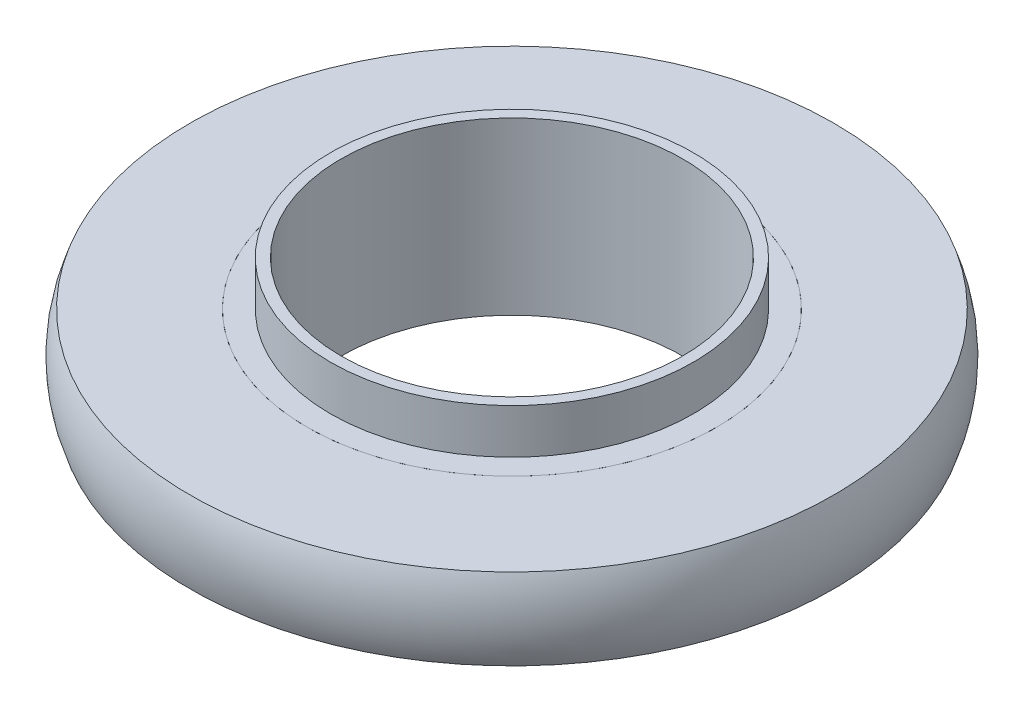
ISO-10303-21;
HEADER;
FILE_DESCRIPTION(('STEP AP214'),'2;1');
FILE_NAME('part.step','',(''),(''),'','','');
FILE_SCHEMA(('AUTOMOTIVE_DESIGN { 1 0 10303 214 1 1 1 1 }'));
ENDSEC;
DATA;
#1=APPLICATION_CONTEXT('core data for automotive mechanical design processes');
#2=APPLICATION_PROTOCOL_DEFINITION('international standard','automotive_design',2000,#1);
#3=PRODUCT_CONTEXT('',#1,'mechanical');
#4=PRODUCT('Part','Part','',(#3));
#5=PRODUCT_RELATED_PRODUCT_CATEGORY('part','',(#4));
#6=PRODUCT_DEFINITION_FORMATION('','',#4);
#7=PRODUCT_DEFINITION_CONTEXT('part definition',#1,'design');
#8=PRODUCT_DEFINITION('design','',#6,#7);
#9=PRODUCT_DEFINITION_SHAPE('','',#8);
#10=(LENGTH_UNIT() NAMED_UNIT(*) SI_UNIT(.MILLI.,.METRE.));
#11=(NAMED_UNIT(*) PLANE_ANGLE_UNIT() SI_UNIT($,.RADIAN.));
#12=(NAMED_UNIT(*) SI_UNIT($,.STERADIAN.) SOLID_ANGLE_UNIT());
#13=UNCERTAINTY_MEASURE_WITH_UNIT(LENGTH_MEASURE(1.E-05),#10,'distance_accuracy_value','');
#14=(GEOMETRIC_REPRESENTATION_CONTEXT(3) GLOBAL_UNCERTAINTY_ASSIGNED_CONTEXT((#13)) GLOBAL_UNIT_ASSIGNED_CONTEXT((#10,
#11,#12)) REPRESENTATION_CONTEXT('',''));
#15=CARTESIAN_POINT('',(0.,0.,0.));
#16=DIRECTION('',(0.,0.,1.));
#17=DIRECTION('',(1.,0.,0.));
#18=AXIS2_PLACEMENT_3D('',#15,#16,#17);
#19=CARTESIAN_POINT('',(0.,0.,0.));
#20=DIRECTION('',(0.,-1.,0.));
#21=DIRECTION('',(0.,0.,-1.));
#22=AXIS2_PLACEMENT_3D('',#19,#20,#21);
#23=TOROIDAL_SURFACE('',#22,14.535,5.3);
#24=CARTESIAN_POINT('',(0.,-1.905,0.));
#25=DIRECTION('',(0.,-1.,0.));
#26=DIRECTION('',(0.,0.,-1.));
#27=AXIS2_PLACEMENT_3D('',#24,#25,#26);
#28=CIRCLE('',#27,9.58919622305939);
#29=CARTESIAN_POINT('',(0.,-1.905,-9.58919622305939));
#30=VERTEX_POINT('',#29);
#31=EDGE_CURVE('E11',#30,#30,#28,.T.);
#32=ORIENTED_EDGE('',*,*,#31,.T.);
#33=EDGE_LOOP('',(#32));
#34=FACE_BOUND('',#33,.T.);
#35=CARTESIAN_POINT('',(0.,1.905,0.));
#36=DIRECTION('',(0.,-1.,0.));
#37=DIRECTION('',(0.,0.,-1.));
#38=AXIS2_PLACEMENT_3D('',#35,#36,#37);
#39=CIRCLE('',#38,9.58919622305939);
#40=CARTESIAN_POINT('',(0.,1.905,-9.58919622305939));
#41=VERTEX_POINT('',#40);
#42=EDGE_CURVE('E56',#41,#41,#39,.T.);
#43=ORIENTED_EDGE('',*,*,#42,.F.);
#44=EDGE_LOOP('',(#43));
#45=FACE_BOUND('',#44,.T.);
#46=ADVANCED_FACE('F42',(#34,#45),#23,.T.);
#47=CARTESIAN_POINT('',(9.58919622305939,-1.905,0.));
#48=DIRECTION('',(0.,-1.,0.));
#49=DIRECTION('',(0.,0.,-1.));
#50=AXIS2_PLACEMENT_3D('',#47,#48,#49);
#51=PLANE('',#50);
#52=CARTESIAN_POINT('',(0.,-1.905,0.));
#53=DIRECTION('',(0.,-1.,0.));
#54=DIRECTION('',(0.,0.,-1.));
#55=AXIS2_PLACEMENT_3D('',#52,#53,#54);
#56=CIRCLE('',#55,15.0808037769406);
#57=CARTESIAN_POINT('',(0.,-1.905,-15.0808037769406));
#58=VERTEX_POINT('',#57);
#59=EDGE_CURVE('E48',#58,#58,#56,.T.);
#60=ORIENTED_EDGE('',*,*,#59,.T.);
#61=EDGE_LOOP('',(#60));
#62=FACE_BOUND('',#61,.T.);
#63=ORIENTED_EDGE('',*,*,#31,.F.);
#64=EDGE_LOOP('',(#63));
#65=FACE_BOUND('',#64,.T.);
#66=ADVANCED_FACE('F66',(#62,#65),#51,.T.);
#67=CARTESIAN_POINT('',(0.,0.,0.));
#68=DIRECTION('',(0.,-1.,0.));
#69=DIRECTION('',(0.,0.,-1.));
#70=AXIS2_PLACEMENT_3D('',#67,#68,#69);
#71=TOROIDAL_SURFACE('',#70,10.135,5.3);
#72=CARTESIAN_POINT('',(0.,1.905,0.));
#73=DIRECTION('',(0.,-1.,0.));
#74=DIRECTION('',(0.,0.,-1.));
#75=AXIS2_PLACEMENT_3D('',#72,#73,#74);
#76=CIRCLE('',#75,15.0808037769406);
#77=CARTESIAN_POINT('',(0.,1.905,-15.0808037769406));
#78=VERTEX_POINT('',#77);
#79=EDGE_CURVE('E52',#78,#78,#76,.T.);
#80=ORIENTED_EDGE('',*,*,#79,.T.);
#81=EDGE_LOOP('',(#80));
#82=FACE_BOUND('',#81,.T.);
#83=ORIENTED_EDGE('',*,*,#59,.F.);
#84=EDGE_LOOP('',(#83));
#85=FACE_BOUND('',#84,.T.);
#86=ADVANCED_FACE('F70',(#82,#85),#71,.T.);
#87=CARTESIAN_POINT('',(9.58919622305939,1.905,0.));
#88=DIRECTION('',(0.,1.,0.));
#89=DIRECTION('',(0.,0.,1.));
#90=AXIS2_PLACEMENT_3D('',#87,#88,#89);
#91=PLANE('',#90);
#92=ORIENTED_EDGE('',*,*,#42,.T.);
#93=EDGE_LOOP('',(#92));
#94=FACE_BOUND('',#93,.T.);
#95=ORIENTED_EDGE('',*,*,#79,.F.);
#96=EDGE_LOOP('',(#95));
#97=FACE_BOUND('',#96,.T.);
#98=ADVANCED_FACE('F62',(#94,#97),#91,.T.);
#99=CLOSED_SHELL('',(#46,#66,#86,#98));
#100=MANIFOLD_SOLID_BREP('B2',#99);
#101=CARTESIAN_POINT('',(8.,4.,0.));
#102=DIRECTION('',(0.,-1.,0.));
#103=DIRECTION('',(0.,0.,-1.));
#104=AXIS2_PLACEMENT_3D('',#101,#102,#103);
#105=PLANE('',#104);
#106=CARTESIAN_POINT('',(0.,4.,0.));
#107=DIRECTION('',(0.,1.,0.));
#108=DIRECTION('',(0.,0.,1.));
#109=AXIS2_PLACEMENT_3D('',#106,#107,#108);
#110=CIRCLE('',#109,8.);
#111=CARTESIAN_POINT('',(0.,4.,8.));
#112=VERTEX_POINT('',#111);
#113=EDGE_CURVE('E41',#112,#112,#110,.T.);
#114=ORIENTED_EDGE('',*,*,#113,.F.);
#115=EDGE_LOOP('',(#114));
#116=FACE_BOUND('',#115,.T.);
#117=CARTESIAN_POINT('',(0.,4.,0.));
#118=DIRECTION('',(0.,1.,0.));
#119=DIRECTION('',(0.,0.,1.));
#120=AXIS2_PLACEMENT_3D('',#117,#118,#119);
#121=CIRCLE('',#120,8.5);
#122=CARTESIAN_POINT('',(0.,4.,8.5));
#123=VERTEX_POINT('',#122);
#124=EDGE_CURVE('E131',#123,#123,#121,.T.);
#125=ORIENTED_EDGE('',*,*,#124,.T.);
#126=EDGE_LOOP('',(#125));
#127=FACE_BOUND('',#126,.T.);
#128=ADVANCED_FACE('F103',(#116,#127),#105,.F.);
#129=CARTESIAN_POINT('',(0.,4.,0.));
#130=DIRECTION('',(0.,1.,0.));
#131=DIRECTION('',(0.,0.,1.));
#132=AXIS2_PLACEMENT_3D('',#129,#130,#131);
#133=CYLINDRICAL_SURFACE('',#132,8.);
#134=CARTESIAN_POINT('',(0.,-4.,0.));
#135=DIRECTION('',(0.,1.,0.));
#136=DIRECTION('',(0.,0.,1.));
#137=AXIS2_PLACEMENT_3D('',#134,#135,#136);
#138=CIRCLE('',#137,8.);
#139=CARTESIAN_POINT('',(0.,-4.,8.));
#140=VERTEX_POINT('',#139);
#141=EDGE_CURVE('E109',#140,#140,#138,.T.);
#142=ORIENTED_EDGE('',*,*,#141,.F.);
#143=EDGE_LOOP('',(#142));
#144=FACE_BOUND('',#143,.T.);
#145=ORIENTED_EDGE('',*,*,#113,.T.);
#146=EDGE_LOOP('',(#145));
#147=FACE_BOUND('',#146,.T.);
#148=ADVANCED_FACE('F168',(#144,#147),#133,.F.);
#149=CARTESIAN_POINT('',(8.,-4.,0.));
#150=DIRECTION('',(0.,1.,0.));
#151=DIRECTION('',(0.,0.,1.));
#152=AXIS2_PLACEMENT_3D('',#149,#150,#151);
#153=PLANE('',#152);
#154=CARTESIAN_POINT('',(0.,-4.,0.));
#155=DIRECTION('',(0.,1.,0.));
#156=DIRECTION('',(0.,0.,1.));
#157=AXIS2_PLACEMENT_3D('',#154,#155,#156);
#158=CIRCLE('',#157,8.5);
#159=CARTESIAN_POINT('',(0.,-4.,8.5));
#160=VERTEX_POINT('',#159);
#161=EDGE_CURVE('E113',#160,#160,#158,.T.);
#162=ORIENTED_EDGE('',*,*,#161,.F.);
#163=EDGE_LOOP('',(#162));
#164=FACE_BOUND('',#163,.T.);
#165=ORIENTED_EDGE('',*,*,#141,.T.);
#166=EDGE_LOOP('',(#165));
#167=FACE_BOUND('',#166,.T.);
#168=ADVANCED_FACE('F163',(#164,#167),#153,.F.);
#169=CARTESIAN_POINT('',(0.,4.,0.));
#170=DIRECTION('',(0.,1.,0.));
#171=DIRECTION('',(0.,0.,1.));
#172=AXIS2_PLACEMENT_3D('',#169,#170,#171);
#173=CYLINDRICAL_SURFACE('',#172,8.5);
#174=CARTESIAN_POINT('',(0.,-1.905,0.));
#175=DIRECTION('',(0.,1.,0.));
#176=DIRECTION('',(0.,0.,1.));
#177=AXIS2_PLACEMENT_3D('',#174,#175,#176);
#178=CIRCLE('',#177,8.5);
#179=CARTESIAN_POINT('',(0.,-1.905,8.5));
#180=VERTEX_POINT('',#179);
#181=EDGE_CURVE('E117',#180,#180,#178,.T.);
#182=ORIENTED_EDGE('',*,*,#181,.F.);
#183=EDGE_LOOP('',(#182));
#184=FACE_BOUND('',#183,.T.);
#185=ORIENTED_EDGE('',*,*,#161,.T.);
#186=EDGE_LOOP('',(#185));
#187=FACE_BOUND('',#186,.T.);
#188=ADVANCED_FACE('F157',(#184,#187),#173,.T.);
#189=CARTESIAN_POINT('',(8.5,-1.905,0.));
#190=DIRECTION('',(0.,1.,0.));
#191=DIRECTION('',(0.,0.,1.));
#192=AXIS2_PLACEMENT_3D('',#189,#190,#191);
#193=PLANE('',#192);
#194=CARTESIAN_POINT('',(0.,-1.905,0.));
#195=DIRECTION('',(0.,1.,0.));
#196=DIRECTION('',(0.,0.,1.));
#197=AXIS2_PLACEMENT_3D('',#194,#195,#196);
#198=CIRCLE('',#197,9.58919622305939);
#199=CARTESIAN_POINT('',(0.,-1.905,9.58919622305939));
#200=VERTEX_POINT('',#199);
#201=EDGE_CURVE('E122',#200,#200,#198,.T.);
#202=ORIENTED_EDGE('',*,*,#201,.F.);
#203=EDGE_LOOP('',(#202));
#204=FACE_BOUND('',#203,.T.);
#205=ORIENTED_EDGE('',*,*,#181,.T.);
#206=EDGE_LOOP('',(#205));
#207=FACE_BOUND('',#206,.T.);
#208=ADVANCED_FACE('F151',(#204,#207),#193,.F.);
#209=CARTESIAN_POINT('',(0.,0.,0.));
#210=DIRECTION('',(0.,1.,0.));
#211=DIRECTION('',(0.,0.,1.));
#212=AXIS2_PLACEMENT_3D('',#209,#210,#211);
#213=TOROIDAL_SURFACE('',#212,14.535,5.3);
#214=CARTESIAN_POINT('',(0.,1.905,0.));
#215=DIRECTION('',(0.,1.,0.));
#216=DIRECTION('',(0.,0.,1.));
#217=AXIS2_PLACEMENT_3D('',#214,#215,#216);
#218=CIRCLE('',#217,9.58919622305939);
#219=CARTESIAN_POINT('',(0.,1.905,9.58919622305939));
#220=VERTEX_POINT('',#219);
#221=EDGE_CURVE('E125',#220,#220,#218,.T.);
#222=ORIENTED_EDGE('',*,*,#221,.F.);
#223=EDGE_LOOP('',(#222));
#224=FACE_BOUND('',#223,.T.);
#225=ORIENTED_EDGE('',*,*,#201,.T.);
#226=EDGE_LOOP('',(#225));
#227=FACE_BOUND('',#226,.T.);
#228=ADVANCED_FACE('F145',(#224,#227),#213,.F.);
#229=CARTESIAN_POINT('',(8.5,1.905,0.));
#230=DIRECTION('',(0.,-1.,0.));
#231=DIRECTION('',(0.,0.,-1.));
#232=AXIS2_PLACEMENT_3D('',#229,#230,#231);
#233=PLANE('',#232);
#234=CARTESIAN_POINT('',(0.,1.905,0.));
#235=DIRECTION('',(0.,1.,0.));
#236=DIRECTION('',(0.,0.,1.));
#237=AXIS2_PLACEMENT_3D('',#234,#235,#236);
#238=CIRCLE('',#237,8.5);
#239=CARTESIAN_POINT('',(0.,1.905,8.5));
#240=VERTEX_POINT('',#239);
#241=EDGE_CURVE('E128',#240,#240,#238,.T.);
#242=ORIENTED_EDGE('',*,*,#241,.F.);
#243=EDGE_LOOP('',(#242));
#244=FACE_BOUND('',#243,.T.);
#245=ORIENTED_EDGE('',*,*,#221,.T.);
#246=EDGE_LOOP('',(#245));
#247=FACE_BOUND('',#246,.T.);
#248=ADVANCED_FACE('F139',(#244,#247),#233,.F.);
#249=CARTESIAN_POINT('',(0.,4.,0.));
#250=DIRECTION('',(0.,1.,0.));
#251=DIRECTION('',(0.,0.,1.));
#252=AXIS2_PLACEMENT_3D('',#249,#250,#251);
#253=CYLINDRICAL_SURFACE('',#252,8.5);
#254=ORIENTED_EDGE('',*,*,#124,.F.);
#255=EDGE_LOOP('',(#254));
#256=FACE_BOUND('',#255,.T.);
#257=ORIENTED_EDGE('',*,*,#241,.T.);
#258=EDGE_LOOP('',(#257));
#259=FACE_BOUND('',#258,.T.);
#260=ADVANCED_FACE('F136',(#256,#259),#253,.T.);
#261=CLOSED_SHELL('',(#128,#148,#168,#188,#208,#228,#248,#260));
#262=MANIFOLD_SOLID_BREP('B6',#261);
#263=ADVANCED_BREP_SHAPE_REPRESENTATION('',(#18,#100,#262),#14);
#264=SHAPE_DEFINITION_REPRESENTATION(#9,#263);
ENDSEC;
END-ISO-10303-21;
